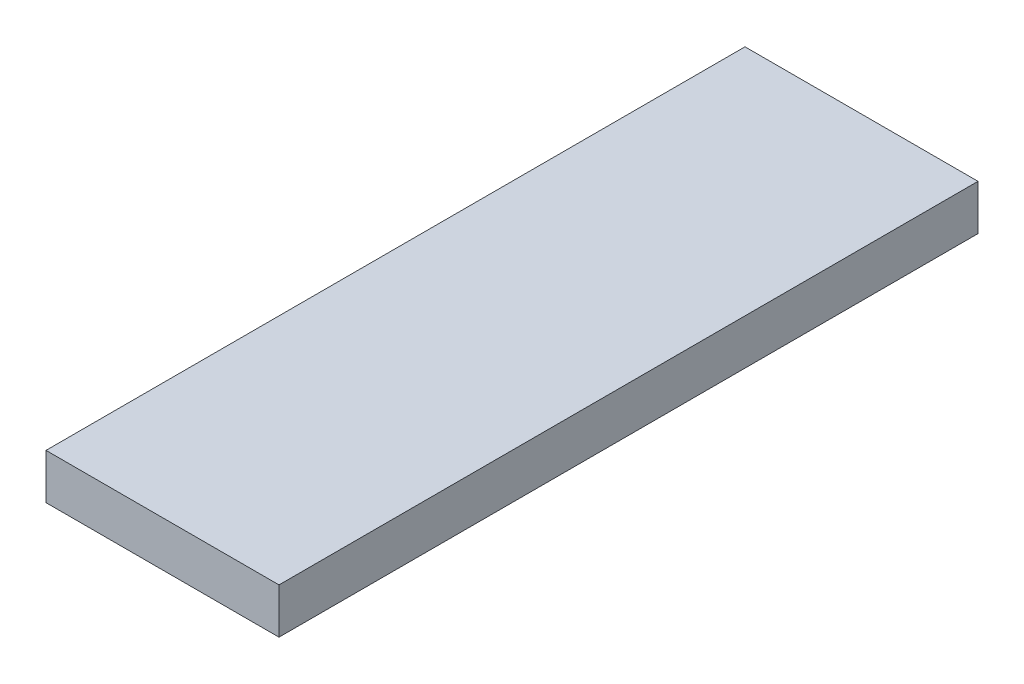
ISO-10303-21;
HEADER;
FILE_DESCRIPTION(('STEP AP214'),'2;1');
FILE_NAME('part.step','',(''),(''),'','','');
FILE_SCHEMA(('AUTOMOTIVE_DESIGN { 1 0 10303 214 1 1 1 1 }'));
ENDSEC;
DATA;
#1=APPLICATION_CONTEXT('core data for automotive mechanical design processes');
#2=APPLICATION_PROTOCOL_DEFINITION('international standard','automotive_design',2000,#1);
#3=PRODUCT_CONTEXT('',#1,'mechanical');
#4=PRODUCT('Part','Part','',(#3));
#5=PRODUCT_RELATED_PRODUCT_CATEGORY('part','',(#4));
#6=PRODUCT_DEFINITION_FORMATION('','',#4);
#7=PRODUCT_DEFINITION_CONTEXT('part definition',#1,'design');
#8=PRODUCT_DEFINITION('design','',#6,#7);
#9=PRODUCT_DEFINITION_SHAPE('','',#8);
#10=(LENGTH_UNIT() NAMED_UNIT(*) SI_UNIT(.MILLI.,.METRE.));
#11=(NAMED_UNIT(*) PLANE_ANGLE_UNIT() SI_UNIT($,.RADIAN.));
#12=(NAMED_UNIT(*) SI_UNIT($,.STERADIAN.) SOLID_ANGLE_UNIT());
#13=UNCERTAINTY_MEASURE_WITH_UNIT(LENGTH_MEASURE(1.E-05),#10,'distance_accuracy_value','');
#14=(GEOMETRIC_REPRESENTATION_CONTEXT(3) GLOBAL_UNCERTAINTY_ASSIGNED_CONTEXT((#13)) GLOBAL_UNIT_ASSIGNED_CONTEXT((#10,
#11,#12)) REPRESENTATION_CONTEXT('',''));
#15=CARTESIAN_POINT('',(0.,0.,0.));
#16=DIRECTION('',(0.,0.,1.));
#17=DIRECTION('',(1.,0.,0.));
#18=AXIS2_PLACEMENT_3D('',#15,#16,#17);
#19=CARTESIAN_POINT('',(0.,0.,2700.));
#20=DIRECTION('',(1.,0.,0.));
#21=DIRECTION('',(0.,0.,-1.));
#22=AXIS2_PLACEMENT_3D('',#19,#20,#21);
#23=PLANE('',#22);
#24=DIRECTION('',(0.,-1.,0.));
#25=VECTOR('',#24,1.);
#26=CARTESIAN_POINT('',(0.,0.,0.));
#27=LINE('',#26,#25);
#28=CARTESIAN_POINT('',(0.,175.,0.));
#29=VERTEX_POINT('',#28);
#30=CARTESIAN_POINT('',(0.,0.,0.));
#31=VERTEX_POINT('',#30);
#32=EDGE_CURVE('E107',#29,#31,#27,.T.);
#33=ORIENTED_EDGE('',*,*,#32,.T.);
#34=DIRECTION('',(0.,0.,-1.));
#35=VECTOR('',#34,1.);
#36=CARTESIAN_POINT('',(0.,0.,2700.));
#37=LINE('',#36,#35);
#38=CARTESIAN_POINT('',(0.,0.,2700.));
#39=VERTEX_POINT('',#38);
#40=EDGE_CURVE('E11',#39,#31,#37,.T.);
#41=ORIENTED_EDGE('',*,*,#40,.F.);
#42=DIRECTION('',(0.,-1.,0.));
#43=VECTOR('',#42,1.);
#44=CARTESIAN_POINT('',(0.,0.,2700.));
#45=LINE('',#44,#43);
#46=CARTESIAN_POINT('',(0.,175.,2700.));
#47=VERTEX_POINT('',#46);
#48=EDGE_CURVE('E91',#47,#39,#45,.T.);
#49=ORIENTED_EDGE('',*,*,#48,.F.);
#50=DIRECTION('',(0.,0.,-1.));
#51=VECTOR('',#50,1.);
#52=CARTESIAN_POINT('',(0.,175.,2700.));
#53=LINE('',#52,#51);
#54=EDGE_CURVE('E103',#47,#29,#53,.T.);
#55=ORIENTED_EDGE('',*,*,#54,.T.);
#56=EDGE_LOOP('',(#33,#41,#49,#55));
#57=FACE_BOUND('',#56,.T.);
#58=ADVANCED_FACE('F39',(#57),#23,.F.);
#59=CARTESIAN_POINT('',(0.,0.,2700.));
#60=DIRECTION('',(0.,1.,0.));
#61=DIRECTION('',(0.,0.,1.));
#62=AXIS2_PLACEMENT_3D('',#59,#60,#61);
#63=PLANE('',#62);
#64=DIRECTION('',(1.,0.,0.));
#65=VECTOR('',#64,1.);
#66=CARTESIAN_POINT('',(0.,0.,0.));
#67=LINE('',#66,#65);
#68=CARTESIAN_POINT('',(900.,0.,0.));
#69=VERTEX_POINT('',#68);
#70=EDGE_CURVE('E96',#31,#69,#67,.T.);
#71=ORIENTED_EDGE('',*,*,#70,.T.);
#72=DIRECTION('',(0.,0.,-1.));
#73=VECTOR('',#72,1.);
#74=CARTESIAN_POINT('',(900.,0.,2700.));
#75=LINE('',#74,#73);
#76=CARTESIAN_POINT('',(900.,0.,2700.));
#77=VERTEX_POINT('',#76);
#78=EDGE_CURVE('E48',#77,#69,#75,.T.);
#79=ORIENTED_EDGE('',*,*,#78,.F.);
#80=DIRECTION('',(1.,0.,0.));
#81=VECTOR('',#80,1.);
#82=CARTESIAN_POINT('',(0.,0.,2700.));
#83=LINE('',#82,#81);
#84=EDGE_CURVE('E86',#39,#77,#83,.T.);
#85=ORIENTED_EDGE('',*,*,#84,.F.);
#86=ORIENTED_EDGE('',*,*,#40,.T.);
#87=EDGE_LOOP('',(#71,#79,#85,#86));
#88=FACE_BOUND('',#87,.T.);
#89=ADVANCED_FACE('F95',(#88),#63,.F.);
#90=CARTESIAN_POINT('',(900.,0.,2700.));
#91=DIRECTION('',(-1.,0.,0.));
#92=DIRECTION('',(0.,-1.,0.));
#93=AXIS2_PLACEMENT_3D('',#90,#91,#92);
#94=PLANE('',#93);
#95=DIRECTION('',(0.,1.,0.));
#96=VECTOR('',#95,1.);
#97=CARTESIAN_POINT('',(900.,0.,0.));
#98=LINE('',#97,#96);
#99=CARTESIAN_POINT('',(900.,175.,0.));
#100=VERTEX_POINT('',#99);
#101=EDGE_CURVE('E73',#69,#100,#98,.T.);
#102=ORIENTED_EDGE('',*,*,#101,.T.);
#103=DIRECTION('',(0.,0.,-1.));
#104=VECTOR('',#103,1.);
#105=CARTESIAN_POINT('',(900.,175.,2700.));
#106=LINE('',#105,#104);
#107=CARTESIAN_POINT('',(900.,175.,2700.));
#108=VERTEX_POINT('',#107);
#109=EDGE_CURVE('E98',#108,#100,#106,.T.);
#110=ORIENTED_EDGE('',*,*,#109,.F.);
#111=DIRECTION('',(0.,1.,0.));
#112=VECTOR('',#111,1.);
#113=CARTESIAN_POINT('',(900.,0.,2700.));
#114=LINE('',#113,#112);
#115=EDGE_CURVE('E89',#77,#108,#114,.T.);
#116=ORIENTED_EDGE('',*,*,#115,.F.);
#117=ORIENTED_EDGE('',*,*,#78,.T.);
#118=EDGE_LOOP('',(#102,#110,#116,#117));
#119=FACE_BOUND('',#118,.T.);
#120=ADVANCED_FACE('F99',(#119),#94,.F.);
#121=CARTESIAN_POINT('',(0.,175.,2700.));
#122=DIRECTION('',(0.,-1.,0.));
#123=DIRECTION('',(0.,0.,-1.));
#124=AXIS2_PLACEMENT_3D('',#121,#122,#123);
#125=PLANE('',#124);
#126=DIRECTION('',(-1.,0.,0.));
#127=VECTOR('',#126,1.);
#128=CARTESIAN_POINT('',(0.,175.,0.));
#129=LINE('',#128,#127);
#130=EDGE_CURVE('E79',#100,#29,#129,.T.);
#131=ORIENTED_EDGE('',*,*,#130,.T.);
#132=ORIENTED_EDGE('',*,*,#54,.F.);
#133=DIRECTION('',(-1.,0.,0.));
#134=VECTOR('',#133,1.);
#135=CARTESIAN_POINT('',(0.,175.,2700.));
#136=LINE('',#135,#134);
#137=EDGE_CURVE('E56',#108,#47,#136,.T.);
#138=ORIENTED_EDGE('',*,*,#137,.F.);
#139=ORIENTED_EDGE('',*,*,#109,.T.);
#140=EDGE_LOOP('',(#131,#132,#138,#139));
#141=FACE_BOUND('',#140,.T.);
#142=ADVANCED_FACE('F120',(#141),#125,.F.);
#143=CARTESIAN_POINT('',(0.,0.,2700.));
#144=DIRECTION('',(0.,0.,-1.));
#145=DIRECTION('',(-1.,0.,0.));
#146=AXIS2_PLACEMENT_3D('',#143,#144,#145);
#147=PLANE('',#146);
#148=ORIENTED_EDGE('',*,*,#48,.T.);
#149=ORIENTED_EDGE('',*,*,#84,.T.);
#150=ORIENTED_EDGE('',*,*,#115,.T.);
#151=ORIENTED_EDGE('',*,*,#137,.T.);
#152=EDGE_LOOP('',(#148,#149,#150,#151));
#153=FACE_BOUND('',#152,.T.);
#154=ADVANCED_FACE('F87',(#153),#147,.F.);
#155=CARTESIAN_POINT('',(0.,0.,0.));
#156=DIRECTION('',(0.,0.,-1.));
#157=DIRECTION('',(-1.,0.,0.));
#158=AXIS2_PLACEMENT_3D('',#155,#156,#157);
#159=PLANE('',#158);
#160=ORIENTED_EDGE('',*,*,#32,.F.);
#161=ORIENTED_EDGE('',*,*,#130,.F.);
#162=ORIENTED_EDGE('',*,*,#101,.F.);
#163=ORIENTED_EDGE('',*,*,#70,.F.);
#164=EDGE_LOOP('',(#160,#161,#162,#163));
#165=FACE_BOUND('',#164,.T.);
#166=ADVANCED_FACE('F123',(#165),#159,.T.);
#167=CLOSED_SHELL('',(#58,#89,#120,#142,#154,#166));
#168=MANIFOLD_SOLID_BREP('B2',#167);
#169=ADVANCED_BREP_SHAPE_REPRESENTATION('',(#18,#168),#14);
#170=SHAPE_DEFINITION_REPRESENTATION(#9,#169);
ENDSEC;
END-ISO-10303-21;
